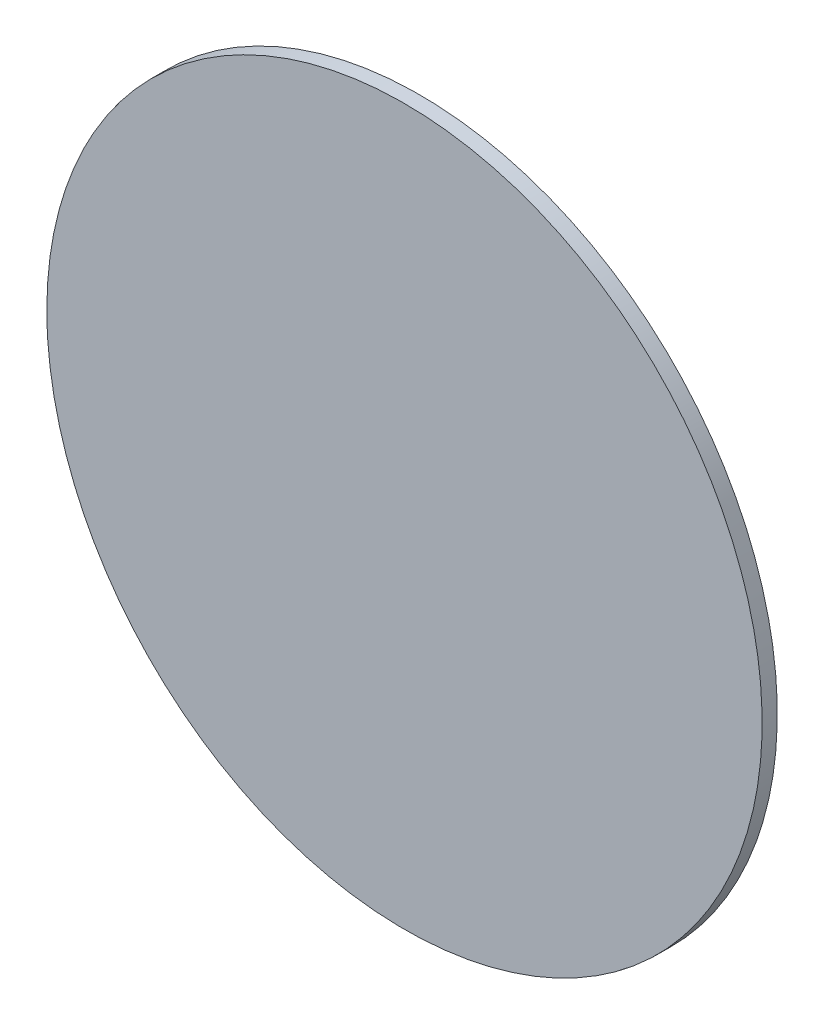
ISO-10303-21;
HEADER;
FILE_DESCRIPTION(('STEP AP214'),'2;1');
FILE_NAME('part.step','',(''),(''),'','','');
FILE_SCHEMA(('AUTOMOTIVE_DESIGN { 1 0 10303 214 1 1 1 1 }'));
ENDSEC;
DATA;
#1=APPLICATION_CONTEXT('core data for automotive mechanical design processes');
#2=APPLICATION_PROTOCOL_DEFINITION('international standard','automotive_design',2000,#1);
#3=PRODUCT_CONTEXT('',#1,'mechanical');
#4=PRODUCT('Part','Part','',(#3));
#5=PRODUCT_RELATED_PRODUCT_CATEGORY('part','',(#4));
#6=PRODUCT_DEFINITION_FORMATION('','',#4);
#7=PRODUCT_DEFINITION_CONTEXT('part definition',#1,'design');
#8=PRODUCT_DEFINITION('design','',#6,#7);
#9=PRODUCT_DEFINITION_SHAPE('','',#8);
#10=(LENGTH_UNIT() NAMED_UNIT(*) SI_UNIT(.MILLI.,.METRE.));
#11=(NAMED_UNIT(*) PLANE_ANGLE_UNIT() SI_UNIT($,.RADIAN.));
#12=(NAMED_UNIT(*) SI_UNIT($,.STERADIAN.) SOLID_ANGLE_UNIT());
#13=UNCERTAINTY_MEASURE_WITH_UNIT(LENGTH_MEASURE(1.E-05),#10,'distance_accuracy_value','');
#14=(GEOMETRIC_REPRESENTATION_CONTEXT(3) GLOBAL_UNCERTAINTY_ASSIGNED_CONTEXT((#13)) GLOBAL_UNIT_ASSIGNED_CONTEXT((#10,
#11,#12)) REPRESENTATION_CONTEXT('',''));
#15=CARTESIAN_POINT('',(0.,0.,0.));
#16=DIRECTION('',(0.,0.,1.));
#17=DIRECTION('',(1.,0.,0.));
#18=AXIS2_PLACEMENT_3D('',#15,#16,#17);
#19=CARTESIAN_POINT('',(-102.811554999158,52.9092603996808,-138.772621606745));
#20=CARTESIAN_POINT('',(-102.811554999158,56.2743110697116,-138.772621606745));
#21=CARTESIAN_POINT('',(-102.480926321692,63.0044124097732,-138.772621606745));
#22=CARTESIAN_POINT('',(-100.997873475449,73.0023425874369,-138.772621606745));
#23=CARTESIAN_POINT('',(-98.5419934087904,82.8067653996365,-138.772621606745));
#24=CARTESIAN_POINT('',(-95.1369375892798,92.3232588950478,-138.772621606745));
#25=CARTESIAN_POINT('',(-90.8154985658514,101.460174039065,-138.772621606745));
#26=CARTESIAN_POINT('',(-85.6192941586399,110.129517344107,-138.772621606745));
#27=CARTESIAN_POINT('',(-79.5983666566208,118.247798294999,-138.772621606745));
#28=CARTESIAN_POINT('',(-72.8107008830125,125.736833408281,-138.772621606745));
#29=CARTESIAN_POINT('',(-65.3216657697302,132.52449918189,-138.772621606745));
#30=CARTESIAN_POINT('',(-57.203384818838,138.545426683909,-138.772621606745));
#31=CARTESIAN_POINT('',(-48.5340415137967,143.74163109112,-138.772621606745));
#32=CARTESIAN_POINT('',(-39.397126369779,148.063070114548,-138.772621606745));
#33=CARTESIAN_POINT('',(-29.8806328743677,151.468125934059,-138.772621606745));
#34=CARTESIAN_POINT('',(-20.0762100621681,153.924006000717,-138.772621606745));
#35=CARTESIAN_POINT('',(-10.0782798845044,155.40705884696,-138.772621606745));
#36=CARTESIAN_POINT('',(0.0168721255879563,155.90300186316,-138.772621606745));
#37=CARTESIAN_POINT('',(10.1120241356803,155.40705884696,-138.772621606745));
#38=CARTESIAN_POINT('',(20.109954313344,153.924006000717,-138.772621606745));
#39=CARTESIAN_POINT('',(29.9143771255436,151.468125934059,-138.772621606745));
#40=CARTESIAN_POINT('',(39.430870620955,148.063070114549,-138.772621606745));
#41=CARTESIAN_POINT('',(48.5677857649726,143.74163109112,-138.772621606745));
#42=CARTESIAN_POINT('',(57.2371290700139,138.545426683909,-138.772621606745));
#43=CARTESIAN_POINT('',(65.3554100209061,132.52449918189,-138.772621606745));
#44=CARTESIAN_POINT('',(72.8444451341884,125.736833408281,-138.772621606745));
#45=CARTESIAN_POINT('',(79.6321109077967,118.247798294999,-138.772621606745));
#46=CARTESIAN_POINT('',(85.6530384098158,110.129517344107,-138.772621606745));
#47=CARTESIAN_POINT('',(90.8492428170273,101.460174039065,-138.772621606745));
#48=CARTESIAN_POINT('',(95.1706818404557,92.3232588950478,-138.772621606745));
#49=CARTESIAN_POINT('',(98.5757376599663,82.8067653996364,-138.772621606745));
#50=CARTESIAN_POINT('',(101.031617726625,73.0023425874369,-138.772621606745));
#51=CARTESIAN_POINT('',(102.514670572868,63.0044124097732,-138.772621606745));
#52=CARTESIAN_POINT('',(103.010613589067,52.9092603996808,-138.772621606745));
#53=CARTESIAN_POINT('',(102.514670572868,42.8141083895885,-138.772621606745));
#54=CARTESIAN_POINT('',(101.031617726624,32.8161782119247,-138.772621606745));
#55=CARTESIAN_POINT('',(98.5757376599663,23.0117553997252,-138.772621606745));
#56=CARTESIAN_POINT('',(95.1706818404557,13.4952619043138,-138.772621606745));
#57=CARTESIAN_POINT('',(90.8492428170273,4.35834676029613,-138.772621606745));
#58=CARTESIAN_POINT('',(85.6530384098158,-4.3109965447451,-138.772621606745));
#59=CARTESIAN_POINT('',(79.6321109077967,-12.4292774956373,-138.772621606745));
#60=CARTESIAN_POINT('',(72.8444451341884,-19.9183126089196,-138.772621606745));
#61=CARTESIAN_POINT('',(65.3554100209061,-26.7059783825279,-138.772621606745));
#62=CARTESIAN_POINT('',(57.2371290700139,-32.7269058845471,-138.772621606745));
#63=CARTESIAN_POINT('',(48.5677857649727,-37.9231102917585,-138.772621606745));
#64=CARTESIAN_POINT('',(39.430870620955,-42.2445493151869,-138.772621606745));
#65=CARTESIAN_POINT('',(29.9143771255437,-45.6496051346975,-138.772621606745));
#66=CARTESIAN_POINT('',(20.1099543133441,-48.1054852013557,-138.772621606745));
#67=CARTESIAN_POINT('',(10.1120241356803,-49.5885380475989,-138.772621606745));
#68=CARTESIAN_POINT('',(0.0168721255879308,-50.0844810637986,-138.772621606745));
#69=CARTESIAN_POINT('',(-10.0782798845044,-49.5885380475989,-138.772621606745));
#70=CARTESIAN_POINT('',(-20.0762100621681,-48.1054852013557,-138.772621606745));
#71=CARTESIAN_POINT('',(-29.8806328743677,-45.6496051346975,-138.772621606745));
#72=CARTESIAN_POINT('',(-39.3971263697791,-42.2445493151869,-138.772621606745));
#73=CARTESIAN_POINT('',(-48.5340415137967,-37.9231102917586,-138.772621606745));
#74=CARTESIAN_POINT('',(-57.203384818838,-32.726905884547,-138.772621606745));
#75=CARTESIAN_POINT('',(-65.3216657697301,-26.705978382528,-138.772621606745));
#76=CARTESIAN_POINT('',(-72.8107008830125,-19.9183126089196,-138.772621606745));
#77=CARTESIAN_POINT('',(-79.5983666566208,-12.4292774956374,-138.772621606745));
#78=CARTESIAN_POINT('',(-85.6192941586399,-4.31099654474514,-138.772621606745));
#79=CARTESIAN_POINT('',(-90.8154985658514,4.35834676029616,-138.772621606745));
#80=CARTESIAN_POINT('',(-95.1369375892797,13.4952619043137,-138.772621606745));
#81=CARTESIAN_POINT('',(-98.5419934087904,23.0117553997251,-138.772621606745));
#82=CARTESIAN_POINT('',(-100.997873475449,32.8161782119247,-138.772621606745));
#83=CARTESIAN_POINT('',(-102.480926321692,42.8141083895885,-138.772621606745));
#84=CARTESIAN_POINT('',(-102.811554999158,49.54420972965,-138.772621606745));
#85=CARTESIAN_POINT('',(-102.811554999158,52.9092603996808,-138.772621606745));
#86=B_SPLINE_CURVE_WITH_KNOTS('',3,(#19,#20,#21,#22,#23,#24,#25,#26,#27,#28,#29,#30,#31,#32,#33,
#34,#35,#36,#37,#38,#39,#40,#41,#42,#43,#44,#45,#46,#47,#48,#49,#50,#51,#52,#53,#54,#55,#56,#57,
#58,#59,#60,#61,#62,#63,#64,#65,#66,#67,#68,#69,#70,#71,#72,#73,#74,#75,#76,#77,#78,#79,#80,#81,
#82,#83,#84,#85),.UNSPECIFIED.,.T.,.F.,(4,1,1,1,1,1,1,1,1,1,1,1,1,1,1,1,1,1,1,1,1,1,1,1,1,1,1,1,
1,1,1,1,1,1,1,1,1,1,1,1,1,1,1,1,1,1,1,1,1,1,1,1,1,1,1,1,1,1,1,1,1,1,1,1,4),(0.,0.015625,0.03125,
0.046875,0.0625,0.0781250000000001,0.0937500000000001,0.109375,0.125,0.140625,0.15625,0.171875,
0.1875,0.203125,0.21875,0.234375,0.25,0.265625,0.28125,0.296875,0.3125,0.328125,0.34375,
0.359375,0.375,0.390625,0.40625,0.421875,0.4375,0.453125,0.46875,0.484375,0.5,0.515625,0.53125,
0.546875,0.5625,0.578125,0.59375,0.609375,0.625,0.640625,0.65625,0.671875,0.6875,0.703125,
0.71875,0.734375,0.75,0.765625,0.78125,0.796875,0.8125,0.828125,0.84375,0.859375,0.875,0.890625,
0.90625,0.921875,0.9375,0.953125,0.96875,0.984375,1.),.UNSPECIFIED.);
#87=DIRECTION('',(0.,0.,-1.));
#88=VECTOR('',#87,1.);
#89=SURFACE_OF_LINEAR_EXTRUSION('',#86,#88);
#90=CARTESIAN_POINT('',(-102.811554999158,52.9092603996808,-138.772621606745));
#91=CARTESIAN_POINT('',(-102.811554999158,56.2743110697116,-138.772621606745));
#92=CARTESIAN_POINT('',(-102.480926321692,63.0044124097732,-138.772621606745));
#93=CARTESIAN_POINT('',(-100.997873475449,73.0023425874369,-138.772621606745));
#94=CARTESIAN_POINT('',(-98.5419934087904,82.8067653996365,-138.772621606745));
#95=CARTESIAN_POINT('',(-95.1369375892798,92.3232588950478,-138.772621606745));
#96=CARTESIAN_POINT('',(-90.8154985658514,101.460174039065,-138.772621606745));
#97=CARTESIAN_POINT('',(-85.6192941586399,110.129517344107,-138.772621606745));
#98=CARTESIAN_POINT('',(-79.5983666566208,118.247798294999,-138.772621606745));
#99=CARTESIAN_POINT('',(-72.8107008830125,125.736833408281,-138.772621606745));
#100=CARTESIAN_POINT('',(-65.3216657697302,132.52449918189,-138.772621606745));
#101=CARTESIAN_POINT('',(-57.203384818838,138.545426683909,-138.772621606745));
#102=CARTESIAN_POINT('',(-48.5340415137967,143.74163109112,-138.772621606745));
#103=CARTESIAN_POINT('',(-39.397126369779,148.063070114548,-138.772621606745));
#104=CARTESIAN_POINT('',(-29.8806328743677,151.468125934059,-138.772621606745));
#105=CARTESIAN_POINT('',(-20.0762100621681,153.924006000717,-138.772621606745));
#106=CARTESIAN_POINT('',(-10.0782798845044,155.40705884696,-138.772621606745));
#107=CARTESIAN_POINT('',(0.0168721255879563,155.90300186316,-138.772621606745));
#108=CARTESIAN_POINT('',(10.1120241356803,155.40705884696,-138.772621606745));
#109=CARTESIAN_POINT('',(20.109954313344,153.924006000717,-138.772621606745));
#110=CARTESIAN_POINT('',(29.9143771255436,151.468125934059,-138.772621606745));
#111=CARTESIAN_POINT('',(39.430870620955,148.063070114549,-138.772621606745));
#112=CARTESIAN_POINT('',(48.5677857649726,143.74163109112,-138.772621606745));
#113=CARTESIAN_POINT('',(57.2371290700139,138.545426683909,-138.772621606745));
#114=CARTESIAN_POINT('',(65.3554100209061,132.52449918189,-138.772621606745));
#115=CARTESIAN_POINT('',(72.8444451341884,125.736833408281,-138.772621606745));
#116=CARTESIAN_POINT('',(79.6321109077967,118.247798294999,-138.772621606745));
#117=CARTESIAN_POINT('',(85.6530384098158,110.129517344107,-138.772621606745));
#118=CARTESIAN_POINT('',(90.8492428170273,101.460174039065,-138.772621606745));
#119=CARTESIAN_POINT('',(95.1706818404557,92.3232588950478,-138.772621606745));
#120=CARTESIAN_POINT('',(98.5757376599663,82.8067653996364,-138.772621606745));
#121=CARTESIAN_POINT('',(101.031617726625,73.0023425874369,-138.772621606745));
#122=CARTESIAN_POINT('',(102.514670572868,63.0044124097732,-138.772621606745));
#123=CARTESIAN_POINT('',(103.010613589067,52.9092603996808,-138.772621606745));
#124=CARTESIAN_POINT('',(102.514670572868,42.8141083895885,-138.772621606745));
#125=CARTESIAN_POINT('',(101.031617726624,32.8161782119247,-138.772621606745));
#126=CARTESIAN_POINT('',(98.5757376599663,23.0117553997252,-138.772621606745));
#127=CARTESIAN_POINT('',(95.1706818404557,13.4952619043138,-138.772621606745));
#128=CARTESIAN_POINT('',(90.8492428170273,4.35834676029613,-138.772621606745));
#129=CARTESIAN_POINT('',(85.6530384098158,-4.3109965447451,-138.772621606745));
#130=CARTESIAN_POINT('',(79.6321109077967,-12.4292774956373,-138.772621606745));
#131=CARTESIAN_POINT('',(72.8444451341884,-19.9183126089196,-138.772621606745));
#132=CARTESIAN_POINT('',(65.3554100209061,-26.7059783825279,-138.772621606745));
#133=CARTESIAN_POINT('',(57.2371290700139,-32.7269058845471,-138.772621606745));
#134=CARTESIAN_POINT('',(48.5677857649727,-37.9231102917585,-138.772621606745));
#135=CARTESIAN_POINT('',(39.430870620955,-42.2445493151869,-138.772621606745));
#136=CARTESIAN_POINT('',(29.9143771255437,-45.6496051346975,-138.772621606745));
#137=CARTESIAN_POINT('',(20.1099543133441,-48.1054852013557,-138.772621606745));
#138=CARTESIAN_POINT('',(10.1120241356803,-49.5885380475989,-138.772621606745));
#139=CARTESIAN_POINT('',(0.0168721255879308,-50.0844810637986,-138.772621606745));
#140=CARTESIAN_POINT('',(-10.0782798845044,-49.5885380475989,-138.772621606745));
#141=CARTESIAN_POINT('',(-20.0762100621681,-48.1054852013557,-138.772621606745));
#142=CARTESIAN_POINT('',(-29.8806328743677,-45.6496051346975,-138.772621606745));
#143=CARTESIAN_POINT('',(-39.3971263697791,-42.2445493151869,-138.772621606745));
#144=CARTESIAN_POINT('',(-48.5340415137967,-37.9231102917586,-138.772621606745));
#145=CARTESIAN_POINT('',(-57.203384818838,-32.726905884547,-138.772621606745));
#146=CARTESIAN_POINT('',(-65.3216657697301,-26.705978382528,-138.772621606745));
#147=CARTESIAN_POINT('',(-72.8107008830125,-19.9183126089196,-138.772621606745));
#148=CARTESIAN_POINT('',(-79.5983666566208,-12.4292774956374,-138.772621606745));
#149=CARTESIAN_POINT('',(-85.6192941586399,-4.31099654474514,-138.772621606745));
#150=CARTESIAN_POINT('',(-90.8154985658514,4.35834676029616,-138.772621606745));
#151=CARTESIAN_POINT('',(-95.1369375892797,13.4952619043137,-138.772621606745));
#152=CARTESIAN_POINT('',(-98.5419934087904,23.0117553997251,-138.772621606745));
#153=CARTESIAN_POINT('',(-100.997873475449,32.8161782119247,-138.772621606745));
#154=CARTESIAN_POINT('',(-102.480926321692,42.8141083895885,-138.772621606745));
#155=CARTESIAN_POINT('',(-102.811554999158,49.54420972965,-138.772621606745));
#156=CARTESIAN_POINT('',(-102.811554999158,52.9092603996808,-138.772621606745));
#157=B_SPLINE_CURVE_WITH_KNOTS('',3,(#90,#91,#92,#93,#94,#95,#96,#97,#98,#99,#100,#101,#102,
#103,#104,#105,#106,#107,#108,#109,#110,#111,#112,#113,#114,#115,#116,#117,#118,#119,#120,#121,
#122,#123,#124,#125,#126,#127,#128,#129,#130,#131,#132,#133,#134,#135,#136,#137,#138,#139,#140,
#141,#142,#143,#144,#145,#146,#147,#148,#149,#150,#151,#152,#153,#154,#155,#156),.UNSPECIFIED.,
.T.,.F.,(4,1,1,1,1,1,1,1,1,1,1,1,1,1,1,1,1,1,1,1,1,1,1,1,1,1,1,1,1,1,1,1,1,1,1,1,1,1,1,1,1,1,1,
1,1,1,1,1,1,1,1,1,1,1,1,1,1,1,1,1,1,1,1,1,4),(0.,0.015625,0.03125,0.046875,0.0625,
0.0781250000000001,0.0937500000000001,0.109375,0.125,0.140625,0.15625,0.171875,0.1875,0.203125,
0.21875,0.234375,0.25,0.265625,0.28125,0.296875,0.3125,0.328125,0.34375,0.359375,0.375,0.390625,
0.40625,0.421875,0.4375,0.453125,0.46875,0.484375,0.5,0.515625,0.53125,0.546875,0.5625,0.578125,
0.59375,0.609375,0.625,0.640625,0.65625,0.671875,0.6875,0.703125,0.71875,0.734375,0.75,0.765625,
0.78125,0.796875,0.8125,0.828125,0.84375,0.859375,0.875,0.890625,0.90625,0.921875,0.9375,
0.953125,0.96875,0.984375,1.),.UNSPECIFIED.);
#158=CARTESIAN_POINT('',(-102.811554999158,52.9092603996808,-138.772621606745));
#159=VERTEX_POINT('',#158);
#160=EDGE_CURVE('E9',#159,#159,#157,.T.);
#161=ORIENTED_EDGE('',*,*,#160,.T.);
#162=EDGE_LOOP('',(#161));
#163=FACE_BOUND('',#162,.T.);
#164=CARTESIAN_POINT('',(-102.811554999158,52.9092603996808,-143.125873264989));
#165=CARTESIAN_POINT('',(-102.811554999158,51.2267350646654,-143.125873264989));
#166=CARTESIAN_POINT('',(-102.770226414475,49.5442097296501,-143.125873264989));
#167=CARTESIAN_POINT('',(-102.605111084173,46.1832099693038,-143.125873264989));
#168=CARTESIAN_POINT('',(-102.481324338555,44.504735543973,-143.125873264989));
#169=CARTESIAN_POINT('',(-102.151491694814,41.1558885126803,-143.125873264989));
#170=CARTESIAN_POINT('',(-101.945445796692,39.4855159067185,-143.125873264989));
#171=CARTESIAN_POINT('',(-101.451689956679,36.1568844113737,-143.125873264989));
#172=CARTESIAN_POINT('',(-101.163980014788,34.4986255219908,-143.125873264989));
#173=CARTESIAN_POINT('',(-100.507491195971,31.1982333570136,-143.125873264989));
#174=CARTESIAN_POINT('',(-100.138712319045,29.5561000814193,-143.125873264989));
#175=CARTESIAN_POINT('',(-99.3210711079743,26.2918933919912,-143.125873264989));
#176=CARTESIAN_POINT('',(-98.872208773829,24.6698199781575,-143.125873264989));
#177=CARTESIAN_POINT('',(-97.8953861261342,21.4496672602223,-143.125873264989));
#178=CARTESIAN_POINT('',(-97.3674258125847,19.8515879561209,-143.125873264989));
#179=CARTESIAN_POINT('',(-96.2337735622867,16.6832421674257,-143.125873264989));
#180=CARTESIAN_POINT('',(-95.6280816255384,15.1129756828318,-143.125873264989));
#181=CARTESIAN_POINT('',(-94.3403324850485,12.004074242927,-143.125873264989));
#182=CARTESIAN_POINT('',(-93.6582752813071,10.465439287616,-143.125873264989));
#183=CARTESIAN_POINT('',(-92.2195296826699,7.42346730159274,-143.125873264989));
#184=CARTESIAN_POINT('',(-91.4628412877742,5.92013027088048,-143.125873264989));
#185=CARTESIAN_POINT('',(-89.8765673826676,2.95242052937066,-143.125873264989));
#186=CARTESIAN_POINT('',(-89.0469818724566,1.48804781857309,-143.125873264989));
#187=CARTESIAN_POINT('',(-87.3169988320934,-1.39825451164182,-143.125873264989));
#188=CARTESIAN_POINT('',(-86.4166013019412,-2.82018413105916,-143.125873264989));
#189=CARTESIAN_POINT('',(-84.5470793170694,-5.61812150704809,-143.125873264989));
#190=CARTESIAN_POINT('',(-83.5779548623499,-6.99412926361968,-143.125873264989));
#191=CARTESIAN_POINT('',(-81.5733950626443,-9.69696526877289,-143.125873264989));
#192=CARTESIAN_POINT('',(-80.5379597176582,-11.0237935173545,-143.125873264989));
#193=CARTESIAN_POINT('',(-78.4031941717203,-13.6250128613836,-143.125873264989));
#194=CARTESIAN_POINT('',(-77.3038639707685,-14.8994039568311,-143.125873264989));
#195=CARTESIAN_POINT('',(-75.0440324183955,-17.3927438486725,-143.125873264989));
#196=CARTESIAN_POINT('',(-73.8835310669743,-18.6116926450664,-143.125873264989));
#197=CARTESIAN_POINT('',(-71.5040809191592,-20.9911427928815,-143.125873264989));
#198=CARTESIAN_POINT('',(-70.2851321227653,-22.1516441443027,-143.125873264989));
#199=CARTESIAN_POINT('',(-67.7917922309238,-24.4114756966757,-143.125873264989));
#200=CARTESIAN_POINT('',(-66.5174011354764,-25.5108058976275,-143.125873264989));
#201=CARTESIAN_POINT('',(-63.9161817914473,-27.6455714435654,-143.125873264989));
#202=CARTESIAN_POINT('',(-62.5893535428657,-28.6810067885515,-143.125873264989));
#203=CARTESIAN_POINT('',(-59.8865175377125,-30.6855665882571,-143.125873264989));
#204=CARTESIAN_POINT('',(-58.5105097811409,-31.6546910429766,-143.125873264989));
#205=CARTESIAN_POINT('',(-55.712572405152,-33.5242130278484,-143.125873264989));
#206=CARTESIAN_POINT('',(-54.2906427857346,-34.4246105580006,-143.125873264989));
#207=CARTESIAN_POINT('',(-51.4043404555197,-36.1545935983638,-143.125873264989));
#208=CARTESIAN_POINT('',(-49.9399677447222,-36.9841791085747,-143.125873264989));
#209=CARTESIAN_POINT('',(-46.9722580032123,-38.5704530136814,-143.125873264989));
#210=CARTESIAN_POINT('',(-45.4689209725001,-39.3271414085771,-143.125873264989));
#211=CARTESIAN_POINT('',(-42.4269489864768,-40.7658870072143,-143.125873264989));
#212=CARTESIAN_POINT('',(-40.8883140311657,-41.4479442109558,-143.125873264989));
#213=CARTESIAN_POINT('',(-37.7794125912609,-42.7356933514456,-143.125873264989));
#214=CARTESIAN_POINT('',(-36.2091461066671,-43.3413852881939,-143.125873264989));
#215=CARTESIAN_POINT('',(-33.0408003179718,-44.4750375384919,-143.125873264989));
#216=CARTESIAN_POINT('',(-31.4427210138704,-45.0029978520414,-143.125873264989));
#217=CARTESIAN_POINT('',(-28.2225682959353,-45.9798204997362,-143.125873264989));
#218=CARTESIAN_POINT('',(-26.6004948821015,-46.4286828338815,-143.125873264989));
#219=CARTESIAN_POINT('',(-23.3362881926735,-47.2463240449524,-143.125873264989));
#220=CARTESIAN_POINT('',(-21.6941549170792,-47.6151029218781,-143.125873264989));
#221=CARTESIAN_POINT('',(-18.393762752102,-48.271591740695,-143.125873264989));
#222=CARTESIAN_POINT('',(-16.7355038627191,-48.5593016825862,-143.125873264989));
#223=CARTESIAN_POINT('',(-13.4068723673743,-49.0530575225994,-143.125873264989));
#224=CARTESIAN_POINT('',(-11.7364997614125,-49.2591034207214,-143.125873264989));
#225=CARTESIAN_POINT('',(-8.38765273011984,-49.5889360644619,-143.125873264989));
#226=CARTESIAN_POINT('',(-6.70917830478898,-49.7127228100804,-143.125873264989));
#227=CARTESIAN_POINT('',(-3.34817854444273,-49.8778381403821,-143.125873264989));
#228=CARTESIAN_POINT('',(-1.66565320942734,-49.9191667250654,-143.125873264989));
#229=CARTESIAN_POINT('',(1.69939746060344,-49.9191667250654,-143.125873264989));
#230=CARTESIAN_POINT('',(3.38192279561883,-49.8778381403821,-143.125873264989));
#231=CARTESIAN_POINT('',(6.7429225559651,-49.7127228100803,-143.125873264989));
#232=CARTESIAN_POINT('',(8.42139698129597,-49.5889360644619,-143.125873264989));
#233=CARTESIAN_POINT('',(11.7702440125887,-49.2591034207214,-143.125873264989));
#234=CARTESIAN_POINT('',(13.4406166185505,-49.0530575225993,-143.125873264989));
#235=CARTESIAN_POINT('',(16.7692481138953,-48.5593016825861,-143.125873264989));
#236=CARTESIAN_POINT('',(18.4275070032782,-48.271591740695,-143.125873264989));
#237=CARTESIAN_POINT('',(21.7278991682555,-47.6151029218781,-143.125873264989));
#238=CARTESIAN_POINT('',(23.3700324438497,-47.2463240449523,-143.125873264989));
#239=CARTESIAN_POINT('',(26.6342391332777,-46.4286828338814,-143.125873264989));
#240=CARTESIAN_POINT('',(28.2563125471115,-45.9798204997361,-143.125873264989));
#241=CARTESIAN_POINT('',(31.4764652650466,-45.0029978520414,-143.125873264989));
#242=CARTESIAN_POINT('',(33.074544569148,-44.4750375384918,-143.125873264989));
#243=CARTESIAN_POINT('',(36.2428903578432,-43.3413852881938,-143.125873264989));
#244=CARTESIAN_POINT('',(37.813156842437,-42.7356933514455,-143.125873264989));
#245=CARTESIAN_POINT('',(40.9220582823419,-41.4479442109557,-143.125873264989));
#246=CARTESIAN_POINT('',(42.4606932376529,-40.7658870072142,-143.125873264989));
#247=CARTESIAN_POINT('',(45.5026652236762,-39.327141408577,-143.125873264989));
#248=CARTESIAN_POINT('',(47.0060022543884,-38.5704530136813,-143.125873264989));
#249=CARTESIAN_POINT('',(49.9737119958983,-36.9841791085746,-143.125873264989));
#250=CARTESIAN_POINT('',(51.4380847066958,-36.1545935983637,-143.125873264989));
#251=CARTESIAN_POINT('',(54.3243870369107,-34.4246105580005,-143.125873264989));
#252=CARTESIAN_POINT('',(55.746316656328,-33.5242130278482,-143.125873264989));
#253=CARTESIAN_POINT('',(58.544254032317,-31.6546910429765,-143.125873264989));
#254=CARTESIAN_POINT('',(59.9202617888885,-30.6855665882569,-143.125873264989));
#255=CARTESIAN_POINT('',(62.6230977940417,-28.6810067885513,-143.125873264989));
#256=CARTESIAN_POINT('',(63.9499260426234,-27.6455714435653,-143.125873264989));
#257=CARTESIAN_POINT('',(66.5511453866525,-25.5108058976274,-143.125873264989));
#258=CARTESIAN_POINT('',(67.8255364820999,-24.4114756966755,-143.125873264989));
#259=CARTESIAN_POINT('',(70.3188763739414,-22.1516441443025,-143.125873264989));
#260=CARTESIAN_POINT('',(71.5378251703353,-20.9911427928814,-143.125873264989));
#261=CARTESIAN_POINT('',(73.9172753181504,-18.6116926450663,-143.125873264989));
#262=CARTESIAN_POINT('',(75.0777766695715,-17.3927438486723,-143.125873264989));
#263=CARTESIAN_POINT('',(77.3376082219445,-14.8994039568309,-143.125873264989));
#264=CARTESIAN_POINT('',(78.4369384228963,-13.6250128613834,-143.125873264989));
#265=CARTESIAN_POINT('',(80.5717039688342,-11.0237935173544,-143.125873264989));
#266=CARTESIAN_POINT('',(81.6071393138203,-9.69696526877273,-143.125873264989));
#267=CARTESIAN_POINT('',(83.6116991135259,-6.99412926361952,-143.125873264989));
#268=CARTESIAN_POINT('',(84.5808235682454,-5.61812150704794,-143.125873264989));
#269=CARTESIAN_POINT('',(86.4503455531172,-2.82018413105903,-143.125873264989));
#270=CARTESIAN_POINT('',(87.3507430832694,-1.3982545116417,-143.125873264989));
#271=CARTESIAN_POINT('',(89.0807261236326,1.48804781857319,-143.125873264989));
#272=CARTESIAN_POINT('',(89.9103116338436,2.95242052937075,-143.125873264989));
#273=CARTESIAN_POINT('',(91.4965855389502,5.92013027088058,-143.125873264989));
#274=CARTESIAN_POINT('',(92.2532739338459,7.42346730159285,-143.125873264989));
#275=CARTESIAN_POINT('',(93.6920195324831,10.4654392876161,-143.125873264989));
#276=CARTESIAN_POINT('',(94.3740767362246,12.0040742429272,-143.125873264989));
#277=CARTESIAN_POINT('',(95.6618258767144,15.112975682832,-143.125873264989));
#278=CARTESIAN_POINT('',(96.2675178134627,16.6832421674258,-143.125873264989));
#279=CARTESIAN_POINT('',(97.4011700637606,19.851587956121,-143.125873264989));
#280=CARTESIAN_POINT('',(97.9291303773102,21.4496672602224,-143.125873264989));
#281=CARTESIAN_POINT('',(98.905953025005,24.6698199781576,-143.125873264989));
#282=CARTESIAN_POINT('',(99.3548153591502,26.2918933919913,-143.125873264989));
#283=CARTESIAN_POINT('',(100.172456570221,29.5561000814194,-143.125873264989));
#284=CARTESIAN_POINT('',(100.541235447147,31.1982333570136,-143.125873264989));
#285=CARTESIAN_POINT('',(101.197724265964,34.4986255219908,-143.125873264989));
#286=CARTESIAN_POINT('',(101.485434207855,36.1568844113738,-143.125873264989));
#287=CARTESIAN_POINT('',(101.979190047868,39.4855159067185,-143.125873264989));
#288=CARTESIAN_POINT('',(102.18523594599,41.1558885126804,-143.125873264989));
#289=CARTESIAN_POINT('',(102.515068589731,44.504735543973,-143.125873264989));
#290=CARTESIAN_POINT('',(102.638855335349,46.1832099693039,-143.125873264989));
#291=CARTESIAN_POINT('',(102.803970665651,49.5442097296502,-143.125873264989));
#292=CARTESIAN_POINT('',(102.845299250334,51.2267350646656,-143.125873264989));
#293=CARTESIAN_POINT('',(102.845299250334,54.5917857346964,-143.125873264989));
#294=CARTESIAN_POINT('',(102.803970665651,56.2743110697118,-143.125873264989));
#295=CARTESIAN_POINT('',(102.638855335349,59.635310830058,-143.125873264989));
#296=CARTESIAN_POINT('',(102.515068589731,61.3137852553889,-143.125873264989));
#297=CARTESIAN_POINT('',(102.18523594599,64.6626322866816,-143.125873264989));
#298=CARTESIAN_POINT('',(101.979190047868,66.3330048926434,-143.125873264989));
#299=CARTESIAN_POINT('',(101.485434207855,69.6616363879882,-143.125873264989));
#300=CARTESIAN_POINT('',(101.197724265964,71.3198952773711,-143.125873264989));
#301=CARTESIAN_POINT('',(100.541235447147,74.6202874423483,-143.125873264989));
#302=CARTESIAN_POINT('',(100.172456570221,76.2624207179426,-143.125873264989));
#303=CARTESIAN_POINT('',(99.3548153591502,79.5266274073706,-143.125873264989));
#304=CARTESIAN_POINT('',(98.9059530250049,81.1487008212043,-143.125873264989));
#305=CARTESIAN_POINT('',(97.9291303773101,84.3688535391395,-143.125873264989));
#306=CARTESIAN_POINT('',(97.4011700637605,85.9669328432409,-143.125873264989));
#307=CARTESIAN_POINT('',(96.2675178134626,89.1352786319361,-143.125873264989));
#308=CARTESIAN_POINT('',(95.6618258767143,90.7055451165299,-143.125873264989));
#309=CARTESIAN_POINT('',(94.3740767362244,93.8144465564348,-143.125873264989));
#310=CARTESIAN_POINT('',(93.6920195324829,95.3530815117458,-143.125873264989));
#311=CARTESIAN_POINT('',(92.2532739338457,98.3950534977691,-143.125873264989));
#312=CARTESIAN_POINT('',(91.49658553895,99.8983905284813,-143.125873264989));
#313=CARTESIAN_POINT('',(89.9103116338434,102.866100269991,-143.125873264989));
#314=CARTESIAN_POINT('',(89.0807261236324,104.330472980789,-143.125873264989));
#315=CARTESIAN_POINT('',(87.3507430832693,107.216775311004,-143.125873264989));
#316=CARTESIAN_POINT('',(86.450345553117,108.638704930421,-143.125873264989));
#317=CARTESIAN_POINT('',(84.5808235682452,111.43664230641,-143.125873264989));
#318=CARTESIAN_POINT('',(83.6116991135257,112.812650062981,-143.125873264989));
#319=CARTESIAN_POINT('',(81.6071393138201,115.515486068135,-143.125873264989));
#320=CARTESIAN_POINT('',(80.571703968834,116.842314316716,-143.125873264989));
#321=CARTESIAN_POINT('',(78.4369384228961,119.443533660745,-143.125873264989));
#322=CARTESIAN_POINT('',(77.3376082219443,120.717924756193,-143.125873264989));
#323=CARTESIAN_POINT('',(75.0777766695713,123.211264648034,-143.125873264989));
#324=CARTESIAN_POINT('',(73.9172753181501,124.430213444428,-143.125873264989));
#325=CARTESIAN_POINT('',(71.537825170335,126.809663592243,-143.125873264989));
#326=CARTESIAN_POINT('',(70.3188763739411,127.970164943664,-143.125873264989));
#327=CARTESIAN_POINT('',(67.8255364820996,130.229996496037,-143.125873264989));
#328=CARTESIAN_POINT('',(66.5511453866522,131.329326696989,-143.125873264989));
#329=CARTESIAN_POINT('',(63.9499260426231,133.464092242927,-143.125873264989));
#330=CARTESIAN_POINT('',(62.6230977940415,134.499527587913,-143.125873264989));
#331=CARTESIAN_POINT('',(59.9202617888883,136.504087387619,-143.125873264989));
#332=CARTESIAN_POINT('',(58.5442540323167,137.473211842338,-143.125873264989));
#333=CARTESIAN_POINT('',(55.7463166563278,139.34273382721,-143.125873264989));
#334=CARTESIAN_POINT('',(54.3243870369104,140.243131357362,-143.125873264989));
#335=CARTESIAN_POINT('',(51.4380847066955,141.973114397725,-143.125873264989));
#336=CARTESIAN_POINT('',(49.973711995898,142.802699907936,-143.125873264989));
#337=CARTESIAN_POINT('',(47.0060022543882,144.388973813043,-143.125873264989));
#338=CARTESIAN_POINT('',(45.5026652236759,145.145662207939,-143.125873264989));
#339=CARTESIAN_POINT('',(42.4606932376526,146.584407806576,-143.125873264989));
#340=CARTESIAN_POINT('',(40.9220582823416,147.266465010317,-143.125873264989));
#341=CARTESIAN_POINT('',(37.8131568424368,148.554214150807,-143.125873264989));
#342=CARTESIAN_POINT('',(36.242890357843,149.159906087556,-143.125873264989));
#343=CARTESIAN_POINT('',(33.0745445691477,150.293558337853,-143.125873264989));
#344=CARTESIAN_POINT('',(31.4764652650463,150.821518651403,-143.125873264989));
#345=CARTESIAN_POINT('',(28.2563125471112,151.798341299098,-143.125873264989));
#346=CARTESIAN_POINT('',(26.6342391332774,152.247203633243,-143.125873264989));
#347=CARTESIAN_POINT('',(23.3700324438494,153.064844844314,-143.125873264989));
#348=CARTESIAN_POINT('',(21.7278991682551,153.43362372124,-143.125873264989));
#349=CARTESIAN_POINT('',(18.4275070032779,154.090112540057,-143.125873264989));
#350=CARTESIAN_POINT('',(16.769248113895,154.377822481948,-143.125873264989));
#351=CARTESIAN_POINT('',(13.4406166185502,154.871578321961,-143.125873264989));
#352=CARTESIAN_POINT('',(11.7702440125884,155.077624220083,-143.125873264989));
#353=CARTESIAN_POINT('',(8.42139698129572,155.407456863824,-143.125873264989));
#354=CARTESIAN_POINT('',(6.74292255596486,155.531243609442,-143.125873264989));
#355=CARTESIAN_POINT('',(3.38192279561861,155.696358939744,-143.125873264989));
#356=CARTESIAN_POINT('',(1.69939746060322,155.737687524427,-143.125873264989));
#357=CARTESIAN_POINT('',(-1.66565320942755,155.737687524427,-143.125873264989));
#358=CARTESIAN_POINT('',(-3.34817854444294,155.696358939744,-143.125873264989));
#359=CARTESIAN_POINT('',(-6.7091783047892,155.531243609442,-143.125873264989));
#360=CARTESIAN_POINT('',(-8.38765273012007,155.407456863824,-143.125873264989));
#361=CARTESIAN_POINT('',(-11.7364997614127,155.077624220083,-143.125873264989));
#362=CARTESIAN_POINT('',(-13.4068723673746,154.871578321961,-143.125873264989));
#363=CARTESIAN_POINT('',(-16.7355038627193,154.377822481948,-143.125873264989));
#364=CARTESIAN_POINT('',(-18.3937627521023,154.090112540057,-143.125873264989));
#365=CARTESIAN_POINT('',(-21.6941549170795,153.43362372124,-143.125873264989));
#366=CARTESIAN_POINT('',(-23.3362881926737,153.064844844314,-143.125873264989));
#367=CARTESIAN_POINT('',(-26.6004948821018,152.247203633243,-143.125873264989));
#368=CARTESIAN_POINT('',(-28.2225682959355,151.798341299098,-143.125873264989));
#369=CARTESIAN_POINT('',(-31.4427210138707,150.821518651403,-143.125873264989));
#370=CARTESIAN_POINT('',(-33.0408003179721,150.293558337853,-143.125873264989));
#371=CARTESIAN_POINT('',(-36.2091461066673,149.159906087555,-143.125873264989));
#372=CARTESIAN_POINT('',(-37.7794125912611,148.554214150807,-143.125873264989));
#373=CARTESIAN_POINT('',(-40.8883140311659,147.266465010317,-143.125873264989));
#374=CARTESIAN_POINT('',(-42.4269489864769,146.584407806576,-143.125873264989));
#375=CARTESIAN_POINT('',(-45.4689209725002,145.145662207939,-143.125873264989));
#376=CARTESIAN_POINT('',(-46.9722580032125,144.388973813043,-143.125873264989));
#377=CARTESIAN_POINT('',(-49.9399677447223,142.802699907936,-143.125873264989));
#378=CARTESIAN_POINT('',(-51.4043404555199,141.973114397725,-143.125873264989));
#379=CARTESIAN_POINT('',(-54.2906427857348,140.243131357362,-143.125873264989));
#380=CARTESIAN_POINT('',(-55.7125724051521,139.34273382721,-143.125873264989));
#381=CARTESIAN_POINT('',(-58.510509781141,137.473211842338,-143.125873264989));
#382=CARTESIAN_POINT('',(-59.8865175377126,136.504087387619,-143.125873264989));
#383=CARTESIAN_POINT('',(-62.5893535428658,134.499527587913,-143.125873264989));
#384=CARTESIAN_POINT('',(-63.9161817914474,133.464092242927,-143.125873264989));
#385=CARTESIAN_POINT('',(-66.5174011354765,131.329326696989,-143.125873264989));
#386=CARTESIAN_POINT('',(-67.7917922309239,130.229996496037,-143.125873264989));
#387=CARTESIAN_POINT('',(-70.2851321227653,127.970164943664,-143.125873264989));
#388=CARTESIAN_POINT('',(-71.5040809191593,126.809663592243,-143.125873264989));
#389=CARTESIAN_POINT('',(-73.8835310669744,124.430213444428,-143.125873264989));
#390=CARTESIAN_POINT('',(-75.0440324183955,123.211264648034,-143.125873264989));
#391=CARTESIAN_POINT('',(-77.3038639707685,120.717924756193,-143.125873264989));
#392=CARTESIAN_POINT('',(-78.4031941717203,119.443533660745,-143.125873264989));
#393=CARTESIAN_POINT('',(-80.5379597176583,116.842314316716,-143.125873264989));
#394=CARTESIAN_POINT('',(-81.5733950626443,115.515486068134,-143.125873264989));
#395=CARTESIAN_POINT('',(-83.5779548623499,112.812650062981,-143.125873264989));
#396=CARTESIAN_POINT('',(-84.5470793170694,111.43664230641,-143.125873264989));
#397=CARTESIAN_POINT('',(-86.4166013019412,108.638704930421,-143.125873264989));
#398=CARTESIAN_POINT('',(-87.3169988320935,107.216775311003,-143.125873264989));
#399=CARTESIAN_POINT('',(-89.0469818724566,104.330472980788,-143.125873264989));
#400=CARTESIAN_POINT('',(-89.8765673826676,102.866100269991,-143.125873264989));
#401=CARTESIAN_POINT('',(-91.4628412877742,99.8983905284811,-143.125873264989));
#402=CARTESIAN_POINT('',(-92.2195296826699,98.3950534977689,-143.125873264989));
#403=CARTESIAN_POINT('',(-93.6582752813071,95.3530815117456,-143.125873264989));
#404=CARTESIAN_POINT('',(-94.3403324850486,93.8144465564346,-143.125873264989));
#405=CARTESIAN_POINT('',(-95.6280816255384,90.7055451165297,-143.125873264989));
#406=CARTESIAN_POINT('',(-96.2337735622868,89.1352786319359,-143.125873264989));
#407=CARTESIAN_POINT('',(-97.3674258125847,85.9669328432407,-143.125873264989));
#408=CARTESIAN_POINT('',(-97.8953861261343,84.3688535391393,-143.125873264989));
#409=CARTESIAN_POINT('',(-98.872208773829,81.1487008212042,-143.125873264989));
#410=CARTESIAN_POINT('',(-99.3210711079742,79.5266274073704,-143.125873264989));
#411=CARTESIAN_POINT('',(-100.138712319045,76.2624207179424,-143.125873264989));
#412=CARTESIAN_POINT('',(-100.507491195971,74.6202874423481,-143.125873264989));
#413=CARTESIAN_POINT('',(-101.163980014788,71.3198952773709,-143.125873264989));
#414=CARTESIAN_POINT('',(-101.451689956679,69.6616363879879,-143.125873264989));
#415=CARTESIAN_POINT('',(-101.945445796692,66.3330048926432,-143.125873264989));
#416=CARTESIAN_POINT('',(-102.151491694814,64.6626322866814,-143.125873264989));
#417=CARTESIAN_POINT('',(-102.481324338555,61.3137852553887,-143.125873264989));
#418=CARTESIAN_POINT('',(-102.605111084173,59.6353108300578,-143.125873264989));
#419=CARTESIAN_POINT('',(-102.770226414475,56.2743110697116,-143.125873264989));
#420=CARTESIAN_POINT('',(-102.811554999158,54.5917857346962,-143.125873264989));
#421=CARTESIAN_POINT('',(-102.811554999158,52.9092603996808,-143.125873264989));
#422=B_SPLINE_CURVE_WITH_KNOTS('',3,(#164,#165,#166,#167,#168,#169,#170,#171,#172,#173,#174,
#175,#176,#177,#178,#179,#180,#181,#182,#183,#184,#185,#186,#187,#188,#189,#190,#191,#192,#193,
#194,#195,#196,#197,#198,#199,#200,#201,#202,#203,#204,#205,#206,#207,#208,#209,#210,#211,#212,
#213,#214,#215,#216,#217,#218,#219,#220,#221,#222,#223,#224,#225,#226,#227,#228,#229,#230,#231,
#232,#233,#234,#235,#236,#237,#238,#239,#240,#241,#242,#243,#244,#245,#246,#247,#248,#249,#250,
#251,#252,#253,#254,#255,#256,#257,#258,#259,#260,#261,#262,#263,#264,#265,#266,#267,#268,#269,
#270,#271,#272,#273,#274,#275,#276,#277,#278,#279,#280,#281,#282,#283,#284,#285,#286,#287,#288,
#289,#290,#291,#292,#293,#294,#295,#296,#297,#298,#299,#300,#301,#302,#303,#304,#305,#306,#307,
#308,#309,#310,#311,#312,#313,#314,#315,#316,#317,#318,#319,#320,#321,#322,#323,#324,#325,#326,
#327,#328,#329,#330,#331,#332,#333,#334,#335,#336,#337,#338,#339,#340,#341,#342,#343,#344,#345,
#346,#347,#348,#349,#350,#351,#352,#353,#354,#355,#356,#357,#358,#359,#360,#361,#362,#363,#364,
#365,#366,#367,#368,#369,#370,#371,#372,#373,#374,#375,#376,#377,#378,#379,#380,#381,#382,#383,
#384,#385,#386,#387,#388,#389,#390,#391,#392,#393,#394,#395,#396,#397,#398,#399,#400,#401,#402,
#403,#404,#405,#406,#407,#408,#409,#410,#411,#412,#413,#414,#415,#416,#417,#418,#419,#420,#421),
.UNSPECIFIED.,.F.,.F.,(4,2,2,2,2,2,2,2,2,2,2,2,2,2,2,2,2,2,2,2,2,2,2,2,2,2,2,2,2,2,2,2,2,2,2,2,
2,2,2,2,2,2,2,2,2,2,2,2,2,2,2,2,2,2,2,2,2,2,2,2,2,2,2,2,2,2,2,2,2,2,2,2,2,2,2,2,2,2,2,2,2,2,2,2,
2,2,2,2,2,2,2,2,2,2,2,2,2,2,2,2,2,2,2,2,2,2,2,2,2,2,2,2,2,2,2,2,2,2,2,2,2,2,2,2,2,2,2,2,4),(0.,
5.04707124554038,10.0941424910808,15.1412137366212,20.1882849821616,25.2353562277021,
30.2824274732425,35.329498718783,40.3765699643234,45.4236412098638,50.4707124554042,
55.5177837009446,60.5648549464851,65.6119261920255,70.658997437566,75.7060686831064,
80.7531399286468,85.8002111741873,90.8472824197277,95.8943536652681,100.941424910809,
105.988496156349,111.035567401889,116.08263864743,121.12970989297,126.176781138511,
131.223852384051,136.270923629592,141.317994875132,146.365066120672,151.412137366213,
156.459208611753,161.506279857294,166.553351102834,171.600422348374,176.647493593915,
181.694564839455,186.741636084996,191.788707330536,196.835778576077,201.882849821617,
206.929921067157,211.976992312698,217.024063558238,222.071134803779,227.118206049319,
232.16527729486,237.2123485404,242.25941978594,247.306491031481,252.353562277021,
257.400633522562,262.447704768102,267.494776013643,272.541847259183,277.588918504723,
282.635989750264,287.683060995804,292.730132241345,297.777203486885,302.824274732426,
307.871345977966,312.918417223506,317.965488469047,323.012559714587,328.059630960128,
333.106702205668,338.153773451209,343.200844696749,348.24791594229,353.29498718783,
358.34205843337,363.389129678911,368.436200924451,373.483272169992,378.530343415532,
383.577414661072,388.624485906613,393.671557152153,398.718628397694,403.765699643234,
408.812770888775,413.859842134315,418.906913379855,423.953984625396,429.001055870936,
434.048127116477,439.095198362017,444.142269607558,449.189340853098,454.236412098639,
459.283483344179,464.330554589719,469.37762583526,474.4246970808,479.471768326341,
484.518839571881,489.565910817422,494.612982062962,499.660053308502,504.707124554043,
509.754195799583,514.801267045124,519.848338290664,524.895409536204,529.942480781745,
534.989552027285,540.036623272826,545.083694518366,550.130765763906,555.177837009447,
560.224908254987,565.271979500528,570.319050746068,575.366121991608,580.413193237149,
585.460264482689,590.507335728229,595.55440697377,600.60147821931,605.648549464851,
610.695620710391,615.742691955931,620.789763201472,625.836834447012,630.883905692553,
635.930976938093,640.978048183633,646.025119429174),.UNSPECIFIED.);
#423=CARTESIAN_POINT('',(-102.811554999158,52.9092603996808,-143.125873264989));
#424=VERTEX_POINT('',#423);
#425=EDGE_CURVE('E24',#424,#424,#422,.F.);
#426=ORIENTED_EDGE('',*,*,#425,.F.);
#427=EDGE_LOOP('',(#426));
#428=FACE_BOUND('',#427,.T.);
#429=ADVANCED_FACE('F14',(#163,#428),#89,.T.);
#430=CARTESIAN_POINT('',(97.1881519725938,29.2926905197242,-138.772621606745));
#431=DIRECTION('',(0.,0.,-1.));
#432=DIRECTION('',(0.,1.,0.));
#433=AXIS2_PLACEMENT_3D('',#430,#431,#432);
#434=PLANE('',#433);
#435=ORIENTED_EDGE('',*,*,#160,.F.);
#436=EDGE_LOOP('',(#435));
#437=FACE_BOUND('',#436,.T.);
#438=ADVANCED_FACE('F62',(#437),#434,.F.);
#439=CARTESIAN_POINT('',(97.1881519725938,29.2926905197242,-143.125873264989));
#440=DIRECTION('',(0.,0.,-1.));
#441=DIRECTION('',(0.,1.,0.));
#442=AXIS2_PLACEMENT_3D('',#439,#440,#441);
#443=PLANE('',#442);
#444=ORIENTED_EDGE('',*,*,#425,.T.);
#445=EDGE_LOOP('',(#444));
#446=FACE_BOUND('',#445,.T.);
#447=ADVANCED_FACE('F31',(#446),#443,.T.);
#448=CLOSED_SHELL('',(#429,#438,#447));
#449=MANIFOLD_SOLID_BREP('B1',#448);
#450=ADVANCED_BREP_SHAPE_REPRESENTATION('',(#18,#449),#14);
#451=SHAPE_DEFINITION_REPRESENTATION(#9,#450);
ENDSEC;
END-ISO-10303-21;
